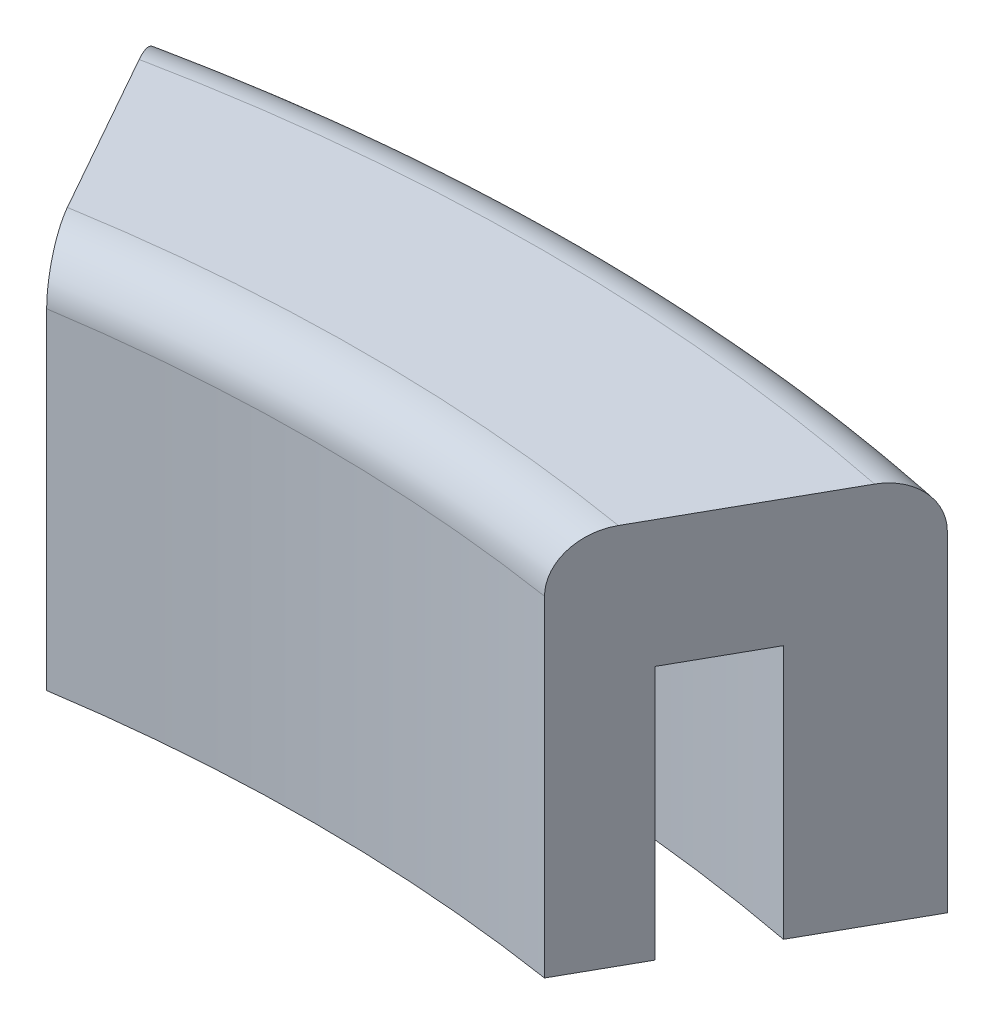
ISO-10303-21;
HEADER;
FILE_DESCRIPTION(('STEP AP214'),'2;1');
FILE_NAME('part.step','',(''),(''),'','','');
FILE_SCHEMA(('AUTOMOTIVE_DESIGN { 1 0 10303 214 1 1 1 1 }'));
ENDSEC;
DATA;
#1=APPLICATION_CONTEXT('core data for automotive mechanical design processes');
#2=APPLICATION_PROTOCOL_DEFINITION('international standard','automotive_design',2000,#1);
#3=PRODUCT_CONTEXT('',#1,'mechanical');
#4=PRODUCT('Part','Part','',(#3));
#5=PRODUCT_RELATED_PRODUCT_CATEGORY('part','',(#4));
#6=PRODUCT_DEFINITION_FORMATION('','',#4);
#7=PRODUCT_DEFINITION_CONTEXT('part definition',#1,'design');
#8=PRODUCT_DEFINITION('design','',#6,#7);
#9=PRODUCT_DEFINITION_SHAPE('','',#8);
#10=(LENGTH_UNIT() NAMED_UNIT(*) SI_UNIT(.MILLI.,.METRE.));
#11=(NAMED_UNIT(*) PLANE_ANGLE_UNIT() SI_UNIT($,.RADIAN.));
#12=(NAMED_UNIT(*) SI_UNIT($,.STERADIAN.) SOLID_ANGLE_UNIT());
#13=UNCERTAINTY_MEASURE_WITH_UNIT(LENGTH_MEASURE(1.E-05),#10,'distance_accuracy_value','');
#14=(GEOMETRIC_REPRESENTATION_CONTEXT(3) GLOBAL_UNCERTAINTY_ASSIGNED_CONTEXT((#13)) GLOBAL_UNIT_ASSIGNED_CONTEXT((#10,
#11,#12)) REPRESENTATION_CONTEXT('',''));
#15=CARTESIAN_POINT('',(0.,0.,0.));
#16=DIRECTION('',(0.,0.,1.));
#17=DIRECTION('',(1.,0.,0.));
#18=AXIS2_PLACEMENT_3D('',#15,#16,#17);
#19=CARTESIAN_POINT('',(0.,0.,0.));
#20=DIRECTION('',(0.,-1.,0.));
#21=DIRECTION('',(0.,0.,-1.));
#22=AXIS2_PLACEMENT_3D('',#19,#20,#21);
#23=PLANE('',#22);
#24=CARTESIAN_POINT('',(0.,0.,0.));
#25=DIRECTION('',(0.,-1.,0.));
#26=DIRECTION('',(0.,0.,-1.));
#27=AXIS2_PLACEMENT_3D('',#24,#25,#26);
#28=CIRCLE('',#27,89.535);
#29=CARTESIAN_POINT('',(-16.7220002769722,0.,-87.9595982922668));
#30=VERTEX_POINT('',#29);
#31=CARTESIAN_POINT('',(16.7220002769722,0.,-87.9595982922667));
#32=VERTEX_POINT('',#31);
#33=EDGE_CURVE('E123',#30,#32,#28,.T.);
#34=ORIENTED_EDGE('',*,*,#33,.F.);
#35=DIRECTION('',(0.490075070619561,0.,0.871680231023529));
#36=VECTOR('',#35,1.);
#37=CARTESIAN_POINT('',(-12.4291561216455,0.,-80.3240591485749));
#38=LINE('',#37,#36);
#39=CARTESIAN_POINT('',(-19.6668571556014,0.,-93.1975172932261));
#40=VERTEX_POINT('',#39);
#41=EDGE_CURVE('E182',#40,#30,#38,.T.);
#42=ORIENTED_EDGE('',*,*,#41,.F.);
#43=CARTESIAN_POINT('',(0.,0.,0.));
#44=DIRECTION('',(0.,1.,0.));
#45=DIRECTION('',(0.,0.,-1.));
#46=AXIS2_PLACEMENT_3D('',#43,#44,#45);
#47=CIRCLE('',#46,95.25);
#48=CARTESIAN_POINT('',(19.6668571556014,0.,-93.1975172932261));
#49=VERTEX_POINT('',#48);
#50=EDGE_CURVE('E161',#49,#40,#47,.T.);
#51=ORIENTED_EDGE('',*,*,#50,.F.);
#52=DIRECTION('',(0.490075070619561,0.,-0.871680231023529));
#53=VECTOR('',#52,1.);
#54=CARTESIAN_POINT('',(12.4291561216455,0.,-80.3240591485749));
#55=LINE('',#54,#53);
#56=EDGE_CURVE('E190',#32,#49,#55,.T.);
#57=ORIENTED_EDGE('',*,*,#56,.F.);
#58=EDGE_LOOP('',(#34,#42,#51,#57));
#59=FACE_BOUND('',#58,.T.);
#60=ADVANCED_FACE('F39',(#59),#23,.T.);
#61=CARTESIAN_POINT('',(0.,19.05,0.));
#62=DIRECTION('',(0.,-1.,0.));
#63=DIRECTION('',(0.,0.,-1.));
#64=AXIS2_PLACEMENT_3D('',#61,#62,#63);
#65=CYLINDRICAL_SURFACE('',#64,95.25);
#66=DIRECTION('',(0.,-1.,0.));
#67=VECTOR('',#66,1.);
#68=CARTESIAN_POINT('',(-19.6668571556014,19.05,-93.1975172932261));
#69=LINE('',#68,#67);
#70=CARTESIAN_POINT('',(-19.6668571556014,16.51,-93.1975172932261));
#71=VERTEX_POINT('',#70);
#72=EDGE_CURVE('E201',#71,#40,#69,.T.);
#73=ORIENTED_EDGE('',*,*,#72,.F.);
#74=CARTESIAN_POINT('',(0.,16.51,0.));
#75=DIRECTION('',(0.,-1.,0.));
#76=DIRECTION('',(0.,0.,-1.));
#77=AXIS2_PLACEMENT_3D('',#74,#75,#76);
#78=CIRCLE('',#77,95.25);
#79=CARTESIAN_POINT('',(19.6668571556014,16.51,-93.1975172932261));
#80=VERTEX_POINT('',#79);
#81=EDGE_CURVE('E11',#71,#80,#78,.T.);
#82=ORIENTED_EDGE('',*,*,#81,.T.);
#83=DIRECTION('',(0.,-1.,0.));
#84=VECTOR('',#83,1.);
#85=CARTESIAN_POINT('',(19.6668571556014,19.05,-93.1975172932261));
#86=LINE('',#85,#84);
#87=EDGE_CURVE('E177',#80,#49,#86,.T.);
#88=ORIENTED_EDGE('',*,*,#87,.T.);
#89=ORIENTED_EDGE('',*,*,#50,.T.);
#90=EDGE_LOOP('',(#73,#82,#88,#89));
#91=FACE_BOUND('',#90,.T.);
#92=ADVANCED_FACE('F241',(#91),#65,.T.);
#93=CARTESIAN_POINT('',(-12.4291561216455,19.05,-80.3240591485749));
#94=DIRECTION('',(0.871680231023529,0.,-0.490075070619561));
#95=DIRECTION('',(-0.490075070619561,0.,-0.871680231023529));
#96=AXIS2_PLACEMENT_3D('',#93,#94,#95);
#97=PLANE('',#96);
#98=DIRECTION('',(0.,-1.,0.));
#99=VECTOR('',#98,1.);
#100=CARTESIAN_POINT('',(-12.4291561216455,19.05,-80.3240591485749));
#101=LINE('',#100,#99);
#102=CARTESIAN_POINT('',(-12.4291561216455,16.51,-80.3240591485749));
#103=VERTEX_POINT('',#102);
#104=CARTESIAN_POINT('',(-12.4291561216455,0.,-80.3240591485749));
#105=VERTEX_POINT('',#104);
#106=EDGE_CURVE('E198',#103,#105,#101,.T.);
#107=ORIENTED_EDGE('',*,*,#106,.F.);
#108=CARTESIAN_POINT('',(-12.4291561216455,16.51,-80.3240591485749));
#109=CARTESIAN_POINT('',(-12.4291513327898,16.5781932813968,-80.3240506307966));
#110=CARTESIAN_POINT('',(-12.4305933635296,16.6463818342037,-80.3266155229196));
#111=CARTESIAN_POINT('',(-12.4363342735061,16.7822443470756,-80.3368266885852));
#112=CARTESIAN_POINT('',(-12.4406326345708,16.8499183982255,-80.3444720404721));
#113=CARTESIAN_POINT('',(-12.452035149954,16.9841037089334,-80.3647533154019));
#114=CARTESIAN_POINT('',(-12.4591322539058,17.0506174551367,-80.377376698192));
#115=CARTESIAN_POINT('',(-12.4760549527925,17.1821653164128,-80.4074765399498));
#116=CARTESIAN_POINT('',(-12.4858805851859,17.247199411159,-80.4249530655436));
#117=CARTESIAN_POINT('',(-12.5193187422661,17.4393803026173,-80.4844284035808));
#118=CARTESIAN_POINT('',(-12.5469049915564,17.5637503678589,-80.533495147833));
#119=CARTESIAN_POINT('',(-12.6116455951052,17.8015710377922,-80.6486471064639));
#120=CARTESIAN_POINT('',(-12.6488031391715,17.915017984807,-80.7147379944477));
#121=CARTESIAN_POINT('',(-12.7325840188624,18.1313313670385,-80.8637562590822));
#122=CARTESIAN_POINT('',(-12.7794361447794,18.2338287494127,-80.9470905774176));
#123=CARTESIAN_POINT('',(-12.8804804838258,18.4224288547402,-81.1268147831239));
#124=CARTESIAN_POINT('',(-12.9346746281893,18.5085272497426,-81.2232081055167));
#125=CARTESIAN_POINT('',(-13.0523276413744,18.6673714782514,-81.4324736076043));
#126=CARTESIAN_POINT('',(-13.116147693152,18.7390027752226,-81.545988211412));
#127=CARTESIAN_POINT('',(-13.2485508046598,18.8607306601969,-81.7814892228824));
#128=CARTESIAN_POINT('',(-13.3171349433334,18.9108223514412,-81.9034775496259));
#129=CARTESIAN_POINT('',(-13.4472093118255,18.983031099941,-82.134836503335));
#130=CARTESIAN_POINT('',(-13.5083080583719,19.0081279399433,-82.243510812023));
#131=CARTESIAN_POINT('',(-13.6315079424449,19.0416136767206,-82.4626423489018));
#132=CARTESIAN_POINT('',(-13.693607540432,19.0500261483219,-82.5730968387647));
#133=CARTESIAN_POINT('',(-13.7557172763478,19.05,-82.6835693606244));
#134=B_SPLINE_CURVE_WITH_KNOTS('',3,(#108,#109,#110,#111,#112,#113,#114,#115,#116,#117,#118,
#119,#120,#121,#122,#123,#124,#125,#126,#127,#128,#129,#130,#131,#132,#133),.UNSPECIFIED.,.F.,
.F.,(4,2,2,2,2,2,2,2,2,2,2,2,4),(0.,0.204508258082241,0.408979426067382,0.61293876388738,
0.81690090188751,1.22439010211601,1.63201528162376,2.05066283502956,2.46942072348423,
2.91336467408295,3.35740949647018,3.7378342678044,4.11772111912589),.UNSPECIFIED.);
#135=CARTESIAN_POINT('',(-13.7557172763478,19.05,-82.6835693606244));
#136=VERTEX_POINT('',#135);
#137=EDGE_CURVE('E49',#103,#136,#134,.T.);
#138=ORIENTED_EDGE('',*,*,#137,.T.);
#139=DIRECTION('',(0.490075070619561,0.,0.871680231023529));
#140=VECTOR('',#139,1.);
#141=CARTESIAN_POINT('',(-12.4291561216455,19.05,-80.3240591485749));
#142=LINE('',#141,#140);
#143=CARTESIAN_POINT('',(-18.3603960404992,19.05,-90.8737583532013));
#144=VERTEX_POINT('',#143);
#145=EDGE_CURVE('E168',#144,#136,#142,.T.);
#146=ORIENTED_EDGE('',*,*,#145,.F.);
#147=CARTESIAN_POINT('',(-18.3603960404992,19.05,-90.8737583532013));
#148=CARTESIAN_POINT('',(-18.3985527142205,19.0499974203888,-90.9416263598771));
#149=CARTESIAN_POINT('',(-18.4366916829216,19.0467572287405,-91.0094628752221));
#150=CARTESIAN_POINT('',(-18.5127074828347,19.0338119587131,-91.1446696506778));
#151=CARTESIAN_POINT('',(-18.5505842969418,19.0241064624317,-91.2120398803644));
#152=CARTESIAN_POINT('',(-18.6634662849979,18.9853107895605,-91.4128193187121));
#153=CARTESIAN_POINT('',(-18.7377308741155,18.9465414239847,-91.544911273761));
#154=CARTESIAN_POINT('',(-18.8820314710967,18.8439139054389,-91.8015739470008));
#155=CARTESIAN_POINT('',(-18.9520629846385,18.7800296092228,-91.9261366712909));
#156=CARTESIAN_POINT('',(-19.0856579829511,18.6285829817012,-92.1637576521859));
#157=CARTESIAN_POINT('',(-19.1492255488344,18.5410357197251,-92.2768231677295));
#158=CARTESIAN_POINT('',(-19.2662545309143,18.3469400575212,-92.4849787264419));
#159=CARTESIAN_POINT('',(-19.3199348265064,18.2409417266686,-92.5804580831127));
#160=CARTESIAN_POINT('',(-19.4173040579661,18.0112204383843,-92.7536454971677));
#161=CARTESIAN_POINT('',(-19.4609923646937,17.8874963656583,-92.8313524355214));
#162=CARTESIAN_POINT('',(-19.5349309450317,17.6320997394793,-92.9628645295952));
#163=CARTESIAN_POINT('',(-19.5657128546048,17.501066874046,-93.0176152885232));
#164=CARTESIAN_POINT('',(-19.6155028917675,17.2300753393295,-93.1061751718932));
#165=CARTESIAN_POINT('',(-19.6345262698066,17.0901284923065,-93.1400114218029));
#166=CARTESIAN_POINT('',(-19.6538143940337,16.8757225402544,-93.1743185669532));
#167=CARTESIAN_POINT('',(-19.6587034863494,16.8028820299293,-93.1830146328719));
#168=CARTESIAN_POINT('',(-19.6652228563188,16.6567070054681,-93.1946104194396));
#169=CARTESIAN_POINT('',(-19.666858026495,16.5833733995911,-93.1975188422556));
#170=CARTESIAN_POINT('',(-19.6668571556014,16.51,-93.1975172932261));
#171=B_SPLINE_CURVE_WITH_KNOTS('',3,(#147,#148,#149,#150,#151,#152,#153,#154,#155,#156,#157,
#158,#159,#160,#161,#162,#163,#164,#165,#166,#167,#168,#169,#170),.UNSPECIFIED.,.F.,.F.,(4,2,2,
2,2,2,2,2,2,2,2,4),(0.,0.233436547561944,0.466888185379904,0.933743888547536,1.40108685481076,
1.86813290058828,2.32309808639797,2.77809191095973,3.21186867134593,3.64508164975512,
3.8653791933426,4.0853452515762),.UNSPECIFIED.);
#172=EDGE_CURVE('E56',#144,#71,#171,.T.);
#173=ORIENTED_EDGE('',*,*,#172,.T.);
#174=ORIENTED_EDGE('',*,*,#72,.T.);
#175=ORIENTED_EDGE('',*,*,#41,.T.);
#176=DIRECTION('',(0.,-1.,0.));
#177=VECTOR('',#176,1.);
#178=CARTESIAN_POINT('',(-16.7220002769722,12.7,-87.9595982922668));
#179=LINE('',#178,#177);
#180=CARTESIAN_POINT('',(-16.7220002769722,12.7,-87.9595982922668));
#181=VERTEX_POINT('',#180);
#182=EDGE_CURVE('E158',#181,#30,#179,.T.);
#183=ORIENTED_EDGE('',*,*,#182,.F.);
#184=DIRECTION('',(-0.49007507061956,0.,-0.871680231023529));
#185=VECTOR('',#184,1.);
#186=CARTESIAN_POINT('',(-14.4169909127447,12.7,-83.8597547875132));
#187=LINE('',#186,#185);
#188=CARTESIAN_POINT('',(-14.4169909127447,12.7,-83.8597547875132));
#189=VERTEX_POINT('',#188);
#190=EDGE_CURVE('E130',#189,#181,#187,.T.);
#191=ORIENTED_EDGE('',*,*,#190,.F.);
#192=DIRECTION('',(0.,-1.,0.));
#193=VECTOR('',#192,1.);
#194=CARTESIAN_POINT('',(-14.4169909127447,12.7,-83.8597547875132));
#195=LINE('',#194,#193);
#196=CARTESIAN_POINT('',(-14.4169909127447,0.,-83.8597547875132));
#197=VERTEX_POINT('',#196);
#198=EDGE_CURVE('E162',#189,#197,#195,.T.);
#199=ORIENTED_EDGE('',*,*,#198,.T.);
#200=EDGE_CURVE('E181',#197,#105,#38,.T.);
#201=ORIENTED_EDGE('',*,*,#200,.T.);
#202=EDGE_LOOP('',(#107,#138,#146,#173,#174,#175,#183,#191,#199,#201));
#203=FACE_BOUND('',#202,.T.);
#204=ADVANCED_FACE('F237',(#203),#97,.F.);
#205=CARTESIAN_POINT('',(0.,19.05,0.));
#206=DIRECTION('',(0.,-1.,0.));
#207=DIRECTION('',(0.,0.,-1.));
#208=AXIS2_PLACEMENT_3D('',#205,#206,#207);
#209=CYLINDRICAL_SURFACE('',#208,81.28);
#210=DIRECTION('',(0.,-1.,0.));
#211=VECTOR('',#210,1.);
#212=CARTESIAN_POINT('',(12.4291561216455,19.05,-80.3240591485749));
#213=LINE('',#212,#211);
#214=CARTESIAN_POINT('',(12.4291561216455,16.51,-80.3240591485749));
#215=VERTEX_POINT('',#214);
#216=CARTESIAN_POINT('',(12.4291561216455,0.,-80.3240591485749));
#217=VERTEX_POINT('',#216);
#218=EDGE_CURVE('E195',#215,#217,#213,.T.);
#219=ORIENTED_EDGE('',*,*,#218,.F.);
#220=CARTESIAN_POINT('',(0.,16.51,0.));
#221=DIRECTION('',(0.,-1.,0.));
#222=DIRECTION('',(0.,0.,-1.));
#223=AXIS2_PLACEMENT_3D('',#220,#221,#222);
#224=CIRCLE('',#223,81.28);
#225=EDGE_CURVE('E64',#215,#103,#224,.F.);
#226=ORIENTED_EDGE('',*,*,#225,.T.);
#227=ORIENTED_EDGE('',*,*,#106,.T.);
#228=CARTESIAN_POINT('',(0.,0.,0.));
#229=DIRECTION('',(0.,-1.,0.));
#230=DIRECTION('',(0.,0.,-1.));
#231=AXIS2_PLACEMENT_3D('',#228,#229,#230);
#232=CIRCLE('',#231,81.28);
#233=EDGE_CURVE('E186',#105,#217,#232,.T.);
#234=ORIENTED_EDGE('',*,*,#233,.T.);
#235=EDGE_LOOP('',(#219,#226,#227,#234));
#236=FACE_BOUND('',#235,.T.);
#237=ADVANCED_FACE('F231',(#236),#209,.F.);
#238=CARTESIAN_POINT('',(12.4291561216455,19.05,-80.3240591485749));
#239=DIRECTION('',(-0.871680231023529,0.,-0.490075070619561));
#240=DIRECTION('',(-0.490075070619561,0.,0.871680231023529));
#241=AXIS2_PLACEMENT_3D('',#238,#239,#240);
#242=PLANE('',#241);
#243=DIRECTION('',(0.490075070619561,0.,-0.871680231023529));
#244=VECTOR('',#243,1.);
#245=CARTESIAN_POINT('',(12.4291561216455,19.05,-80.3240591485749));
#246=LINE('',#245,#244);
#247=CARTESIAN_POINT('',(13.7557172763478,19.05,-82.6835693606244));
#248=VERTEX_POINT('',#247);
#249=CARTESIAN_POINT('',(18.3603960404992,19.05,-90.8737583532013));
#250=VERTEX_POINT('',#249);
#251=EDGE_CURVE('E172',#248,#250,#246,.T.);
#252=ORIENTED_EDGE('',*,*,#251,.F.);
#253=CARTESIAN_POINT('',(13.7557172763478,19.05,-82.6835693606244));
#254=CARTESIAN_POINT('',(13.7165702667307,19.0499968207485,-82.6139398764236));
#255=CARTESIAN_POINT('',(13.677441786743,19.0466665847418,-82.5443433502584));
#256=CARTESIAN_POINT('',(13.5994543065963,19.0333701178026,-82.405629612738));
#257=CARTESIAN_POINT('',(13.5605953230507,19.0234034813728,-82.3365124309325));
#258=CARTESIAN_POINT('',(13.4447630548586,18.9835714586213,-82.1304854274163));
#259=CARTESIAN_POINT('',(13.3685502885765,18.9437739742284,-81.9949283144301));
#260=CARTESIAN_POINT('',(13.2204659750648,18.8384266676624,-81.7315356704223));
#261=CARTESIAN_POINT('',(13.1485989818381,18.7728503531405,-81.6037082394542));
#262=CARTESIAN_POINT('',(13.0115348975456,18.617297671143,-81.3599169106888));
#263=CARTESIAN_POINT('',(12.9463333354757,18.5273378094102,-81.2439450604652));
#264=CARTESIAN_POINT('',(12.8266789841348,18.3281291551679,-81.0311198447531));
#265=CARTESIAN_POINT('',(12.7719612922374,18.2195440504955,-80.9337953057718));
#266=CARTESIAN_POINT('',(12.6729388487977,17.984037729728,-80.7576673785445));
#267=CARTESIAN_POINT('',(12.6286338111656,17.8571170175623,-80.6788634814399));
#268=CARTESIAN_POINT('',(12.5546747505089,17.596999125787,-80.5473149597041));
#269=CARTESIAN_POINT('',(12.5242866049327,17.4646695608889,-80.4932645757033));
#270=CARTESIAN_POINT('',(12.4756234895051,17.1911352685087,-80.4067091105485));
#271=CARTESIAN_POINT('',(12.4573293502816,17.0499449764384,-80.3741699334697));
#272=CARTESIAN_POINT('',(12.4400410794091,16.8411391472179,-80.3434198609776));
#273=CARTESIAN_POINT('',(12.4359606038562,16.7751377000739,-80.3361620548049));
#274=CARTESIAN_POINT('',(12.4305202758684,16.6427693511699,-80.3264855243271));
#275=CARTESIAN_POINT('',(12.4291563533809,16.5764031457413,-80.3240595607549));
#276=CARTESIAN_POINT('',(12.4291561216455,16.51,-80.3240591485749));
#277=B_SPLINE_CURVE_WITH_KNOTS('',3,(#253,#254,#255,#256,#257,#258,#259,#260,#261,#262,#263,
#264,#265,#266,#267,#268,#269,#270,#271,#272,#273,#274,#275,#276),.UNSPECIFIED.,.F.,.F.,(4,2,2,
2,2,2,2,2,2,2,2,4),(0.,0.239493957206952,0.479002549311422,0.95811546586929,1.43772204906716,
1.91700478366649,2.38183033633819,2.84664311633693,3.2828366660777,3.71833716730013,
3.91771432658818,4.11679254536068),.UNSPECIFIED.);
#278=EDGE_CURVE('E220',#248,#215,#277,.T.);
#279=ORIENTED_EDGE('',*,*,#278,.T.);
#280=ORIENTED_EDGE('',*,*,#218,.T.);
#281=CARTESIAN_POINT('',(14.4169909127447,0.,-83.8597547875131));
#282=VERTEX_POINT('',#281);
#283=EDGE_CURVE('E173',#217,#282,#55,.T.);
#284=ORIENTED_EDGE('',*,*,#283,.T.);
#285=DIRECTION('',(0.,-1.,0.));
#286=VECTOR('',#285,1.);
#287=CARTESIAN_POINT('',(14.4169909127447,12.7,-83.8597547875132));
#288=LINE('',#287,#286);
#289=CARTESIAN_POINT('',(14.4169909127447,12.7,-83.8597547875132));
#290=VERTEX_POINT('',#289);
#291=EDGE_CURVE('E129',#290,#282,#288,.T.);
#292=ORIENTED_EDGE('',*,*,#291,.F.);
#293=DIRECTION('',(-0.490075070619559,0.,0.87168023102353));
#294=VECTOR('',#293,1.);
#295=CARTESIAN_POINT('',(16.7220002769722,12.7,-87.9595982922667));
#296=LINE('',#295,#294);
#297=CARTESIAN_POINT('',(16.7220002769722,12.7,-87.9595982922667));
#298=VERTEX_POINT('',#297);
#299=EDGE_CURVE('E136',#298,#290,#296,.T.);
#300=ORIENTED_EDGE('',*,*,#299,.F.);
#301=DIRECTION('',(0.,-1.,0.));
#302=VECTOR('',#301,1.);
#303=CARTESIAN_POINT('',(16.7220002769722,12.7,-87.9595982922667));
#304=LINE('',#303,#302);
#305=EDGE_CURVE('E117',#298,#32,#304,.T.);
#306=ORIENTED_EDGE('',*,*,#305,.T.);
#307=ORIENTED_EDGE('',*,*,#56,.T.);
#308=ORIENTED_EDGE('',*,*,#87,.F.);
#309=CARTESIAN_POINT('',(19.6668571556014,16.51,-93.1975172932261));
#310=CARTESIAN_POINT('',(19.6668614846147,16.5790507691689,-93.1975249930982));
#311=CARTESIAN_POINT('',(19.6654108810213,16.6480972997001,-93.1949448527254));
#312=CARTESIAN_POINT('',(19.6596331150011,16.7856781281137,-93.1846681324406));
#313=CARTESIAN_POINT('',(19.6553063511179,16.8542124956352,-93.1769722614049));
#314=CARTESIAN_POINT('',(19.6438209917402,16.9901492735192,-93.156543634617));
#315=CARTESIAN_POINT('',(19.6366680480399,17.0575536648669,-93.1438209315232));
#316=CARTESIAN_POINT('',(19.6196020041478,17.1908723669692,-93.113466126771));
#317=CARTESIAN_POINT('',(19.609688889713,17.2567866700327,-93.0958339997791));
#318=CARTESIAN_POINT('',(19.5759255099969,17.4516071696763,-93.0357801990546));
#319=CARTESIAN_POINT('',(19.5480411605112,17.5777085504041,-92.986183233898));
#320=CARTESIAN_POINT('',(19.4824950128937,17.8187532684181,-92.8695984808198));
#321=CARTESIAN_POINT('',(19.4448314758481,17.9336946162525,-92.8026075999503));
#322=CARTESIAN_POINT('',(19.3601127831044,18.1517509954556,-92.6519212784251));
#323=CARTESIAN_POINT('',(19.3128917978364,18.2545978255149,-92.5679308822283));
#324=CARTESIAN_POINT('',(19.2109714814124,18.4434803430926,-92.3866486046903));
#325=CARTESIAN_POINT('',(19.1562703627815,18.5295120004341,-92.2893535440271));
#326=CARTESIAN_POINT('',(19.0384127020835,18.6863271050146,-92.0797240422138));
#327=CARTESIAN_POINT('',(18.9749912930456,18.7562809817358,-91.9669184909905));
#328=CARTESIAN_POINT('',(18.8434652664208,18.87451549278,-91.7329775212347));
#329=CARTESIAN_POINT('',(18.7753602309598,18.922794190338,-91.6118413594433));
#330=CARTESIAN_POINT('',(18.649470854993,18.9897835367745,-91.3879261127701));
#331=CARTESIAN_POINT('',(18.5921710181986,19.0123596949312,-91.286008798528));
#332=CARTESIAN_POINT('',(18.4767158574681,19.0424685446648,-91.0806525435135));
#333=CARTESIAN_POINT('',(18.4185619311062,19.0500235379281,-90.9772160885598));
#334=CARTESIAN_POINT('',(18.3603960404993,19.05,-90.8737583532013));
#335=B_SPLINE_CURVE_WITH_KNOTS('',3,(#309,#310,#311,#312,#313,#314,#315,#316,#317,#318,#319,
#320,#321,#322,#323,#324,#325,#326,#327,#328,#329,#330,#331,#332,#333,#334),.UNSPECIFIED.,.F.,
.F.,(4,2,2,2,2,2,2,2,2,2,2,2,4),(0.,0.207081518393647,0.414134347911346,0.620775192089276,
0.827417102591814,1.24034733807054,1.65335105024319,2.07425298521675,2.49525567650073,
2.93463639488619,3.37405636590481,3.73035947741954,4.08613319512602),.UNSPECIFIED.);
#336=EDGE_CURVE('E212',#80,#250,#335,.T.);
#337=ORIENTED_EDGE('',*,*,#336,.T.);
#338=EDGE_LOOP('',(#252,#279,#280,#284,#292,#300,#306,#307,#308,#337));
#339=FACE_BOUND('',#338,.T.);
#340=ADVANCED_FACE('F144',(#339),#242,.F.);
#341=CARTESIAN_POINT('',(0.,19.05,0.));
#342=DIRECTION('',(0.,-1.,0.));
#343=DIRECTION('',(0.,0.,-1.));
#344=AXIS2_PLACEMENT_3D('',#341,#342,#343);
#345=PLANE('',#344);
#346=ORIENTED_EDGE('',*,*,#145,.T.);
#347=CARTESIAN_POINT('',(0.,19.05,0.));
#348=DIRECTION('',(0.,-1.,0.));
#349=DIRECTION('',(0.,0.,-1.));
#350=AXIS2_PLACEMENT_3D('',#347,#348,#349);
#351=CIRCLE('',#350,83.82);
#352=EDGE_CURVE('E208',#136,#248,#351,.T.);
#353=ORIENTED_EDGE('',*,*,#352,.T.);
#354=ORIENTED_EDGE('',*,*,#251,.T.);
#355=CARTESIAN_POINT('',(0.,19.05,0.));
#356=DIRECTION('',(0.,-1.,0.));
#357=DIRECTION('',(0.,0.,-1.));
#358=AXIS2_PLACEMENT_3D('',#355,#356,#357);
#359=CIRCLE('',#358,92.71);
#360=EDGE_CURVE('E204',#250,#144,#359,.F.);
#361=ORIENTED_EDGE('',*,*,#360,.T.);
#362=EDGE_LOOP('',(#346,#353,#354,#361));
#363=FACE_BOUND('',#362,.T.);
#364=ADVANCED_FACE('F230',(#363),#345,.F.);
#365=CARTESIAN_POINT('',(0.,0.,0.));
#366=DIRECTION('',(0.,1.,0.));
#367=DIRECTION('',(0.,0.,-1.));
#368=AXIS2_PLACEMENT_3D('',#365,#366,#367);
#369=CIRCLE('',#368,85.09);
#370=EDGE_CURVE('E141',#282,#197,#369,.T.);
#371=ORIENTED_EDGE('',*,*,#370,.F.);
#372=ORIENTED_EDGE('',*,*,#283,.F.);
#373=ORIENTED_EDGE('',*,*,#233,.F.);
#374=ORIENTED_EDGE('',*,*,#200,.F.);
#375=EDGE_LOOP('',(#371,#372,#373,#374));
#376=FACE_BOUND('',#375,.T.);
#377=ADVANCED_FACE('F232',(#376),#23,.T.);
#378=CARTESIAN_POINT('',(0.,12.7,0.));
#379=DIRECTION('',(0.,-1.,0.));
#380=DIRECTION('',(0.,0.,-1.));
#381=AXIS2_PLACEMENT_3D('',#378,#379,#380);
#382=CYLINDRICAL_SURFACE('',#381,89.535);
#383=ORIENTED_EDGE('',*,*,#33,.T.);
#384=ORIENTED_EDGE('',*,*,#305,.F.);
#385=CARTESIAN_POINT('',(0.,12.7,0.));
#386=DIRECTION('',(0.,-1.,0.));
#387=DIRECTION('',(0.,0.,-1.));
#388=AXIS2_PLACEMENT_3D('',#385,#386,#387);
#389=CIRCLE('',#388,89.535);
#390=EDGE_CURVE('E120',#181,#298,#389,.T.);
#391=ORIENTED_EDGE('',*,*,#390,.F.);
#392=ORIENTED_EDGE('',*,*,#182,.T.);
#393=EDGE_LOOP('',(#383,#384,#391,#392));
#394=FACE_BOUND('',#393,.T.);
#395=ADVANCED_FACE('F119',(#394),#382,.F.);
#396=CARTESIAN_POINT('',(0.,12.7,0.));
#397=DIRECTION('',(0.,-1.,0.));
#398=DIRECTION('',(0.,0.,-1.));
#399=AXIS2_PLACEMENT_3D('',#396,#397,#398);
#400=CYLINDRICAL_SURFACE('',#399,85.09);
#401=ORIENTED_EDGE('',*,*,#370,.T.);
#402=ORIENTED_EDGE('',*,*,#198,.F.);
#403=CARTESIAN_POINT('',(0.,12.7,0.));
#404=DIRECTION('',(0.,1.,0.));
#405=DIRECTION('',(0.,0.,-1.));
#406=AXIS2_PLACEMENT_3D('',#403,#404,#405);
#407=CIRCLE('',#406,85.09);
#408=EDGE_CURVE('E147',#290,#189,#407,.T.);
#409=ORIENTED_EDGE('',*,*,#408,.F.);
#410=ORIENTED_EDGE('',*,*,#291,.T.);
#411=EDGE_LOOP('',(#401,#402,#409,#410));
#412=FACE_BOUND('',#411,.T.);
#413=ADVANCED_FACE('F263',(#412),#400,.T.);
#414=CARTESIAN_POINT('',(0.,12.7,0.));
#415=DIRECTION('',(0.,-1.,0.));
#416=DIRECTION('',(0.,0.,-1.));
#417=AXIS2_PLACEMENT_3D('',#414,#415,#416);
#418=PLANE('',#417);
#419=ORIENTED_EDGE('',*,*,#390,.T.);
#420=ORIENTED_EDGE('',*,*,#299,.T.);
#421=ORIENTED_EDGE('',*,*,#408,.T.);
#422=ORIENTED_EDGE('',*,*,#190,.T.);
#423=EDGE_LOOP('',(#419,#420,#421,#422));
#424=FACE_BOUND('',#423,.T.);
#425=ADVANCED_FACE('F134',(#424),#418,.T.);
#426=CARTESIAN_POINT('',(0.,16.51,0.));
#427=DIRECTION('',(0.,-1.,0.));
#428=DIRECTION('',(0.,0.,-1.));
#429=AXIS2_PLACEMENT_3D('',#426,#427,#428);
#430=TOROIDAL_SURFACE('',#429,83.82,2.54);
#431=ORIENTED_EDGE('',*,*,#137,.F.);
#432=ORIENTED_EDGE('',*,*,#225,.F.);
#433=ORIENTED_EDGE('',*,*,#278,.F.);
#434=ORIENTED_EDGE('',*,*,#352,.F.);
#435=EDGE_LOOP('',(#431,#432,#433,#434));
#436=FACE_BOUND('',#435,.T.);
#437=ADVANCED_FACE('F253',(#436),#430,.T.);
#438=CARTESIAN_POINT('',(0.,16.51,0.));
#439=DIRECTION('',(0.,-1.,0.));
#440=DIRECTION('',(0.,0.,-1.));
#441=AXIS2_PLACEMENT_3D('',#438,#439,#440);
#442=TOROIDAL_SURFACE('',#441,92.71,2.54);
#443=ORIENTED_EDGE('',*,*,#336,.F.);
#444=ORIENTED_EDGE('',*,*,#81,.F.);
#445=ORIENTED_EDGE('',*,*,#172,.F.);
#446=ORIENTED_EDGE('',*,*,#360,.F.);
#447=EDGE_LOOP('',(#443,#444,#445,#446));
#448=FACE_BOUND('',#447,.T.);
#449=ADVANCED_FACE('F41',(#448),#442,.T.);
#450=CLOSED_SHELL('',(#60,#92,#204,#237,#340,#364,#377,#395,#413,#425,#437,#449));
#451=MANIFOLD_SOLID_BREP('B2',#450);
#452=ADVANCED_BREP_SHAPE_REPRESENTATION('',(#18,#451),#14);
#453=SHAPE_DEFINITION_REPRESENTATION(#9,#452);
ENDSEC;
END-ISO-10303-21;
